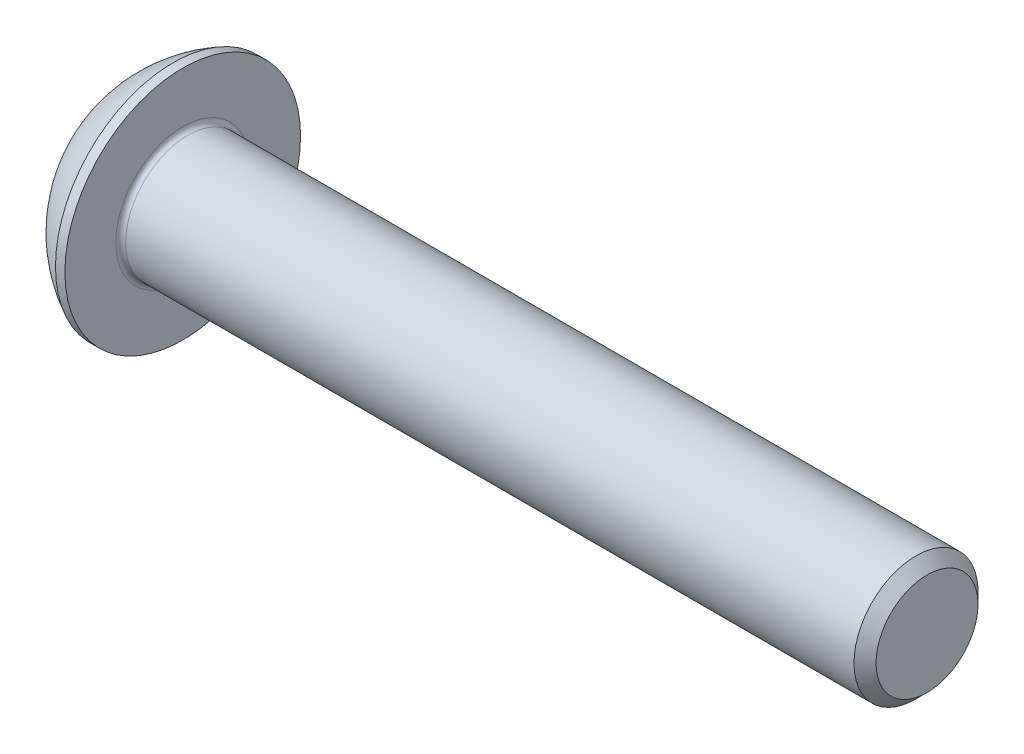
ISO-10303-21;
HEADER;
FILE_DESCRIPTION(('STEP AP214'),'2;1');
FILE_NAME('part.step','',(''),(''),'','','');
FILE_SCHEMA(('AUTOMOTIVE_DESIGN { 1 0 10303 214 1 1 1 1 }'));
ENDSEC;
DATA;
#1=APPLICATION_CONTEXT('core data for automotive mechanical design processes');
#2=APPLICATION_PROTOCOL_DEFINITION('international standard','automotive_design',2000,#1);
#3=PRODUCT_CONTEXT('',#1,'mechanical');
#4=PRODUCT('Part','Part','',(#3));
#5=PRODUCT_RELATED_PRODUCT_CATEGORY('part','',(#4));
#6=PRODUCT_DEFINITION_FORMATION('','',#4);
#7=PRODUCT_DEFINITION_CONTEXT('part definition',#1,'design');
#8=PRODUCT_DEFINITION('design','',#6,#7);
#9=PRODUCT_DEFINITION_SHAPE('','',#8);
#10=(LENGTH_UNIT() NAMED_UNIT(*) SI_UNIT(.MILLI.,.METRE.));
#11=(NAMED_UNIT(*) PLANE_ANGLE_UNIT() SI_UNIT($,.RADIAN.));
#12=(NAMED_UNIT(*) SI_UNIT($,.STERADIAN.) SOLID_ANGLE_UNIT());
#13=UNCERTAINTY_MEASURE_WITH_UNIT(LENGTH_MEASURE(1.E-05),#10,'distance_accuracy_value','');
#14=(GEOMETRIC_REPRESENTATION_CONTEXT(3) GLOBAL_UNCERTAINTY_ASSIGNED_CONTEXT((#13)) GLOBAL_UNIT_ASSIGNED_CONTEXT((#10,
#11,#12)) REPRESENTATION_CONTEXT('',''));
#15=CARTESIAN_POINT('',(0.,0.,0.));
#16=DIRECTION('',(0.,0.,1.));
#17=DIRECTION('',(1.,0.,0.));
#18=AXIS2_PLACEMENT_3D('',#15,#16,#17);
#19=CARTESIAN_POINT('',(0.,0.,0.));
#20=DIRECTION('',(-1.,0.,0.));
#21=DIRECTION('',(0.,0.,1.));
#22=AXIS2_PLACEMENT_3D('',#19,#20,#21);
#23=PLANE('',#22);
#24=CARTESIAN_POINT('',(0.,0.,0.));
#25=DIRECTION('',(-1.,0.,0.));
#26=DIRECTION('',(0.,0.,1.));
#27=AXIS2_PLACEMENT_3D('',#24,#25,#26);
#28=CIRCLE('',#27,2.375);
#29=CARTESIAN_POINT('',(0.,0.,2.375));
#30=VERTEX_POINT('',#29);
#31=EDGE_CURVE('E150',#30,#30,#28,.T.);
#32=ORIENTED_EDGE('',*,*,#31,.T.);
#33=EDGE_LOOP('',(#32));
#34=FACE_BOUND('',#33,.T.);
#35=DIRECTION('',(0.,-1.,0.));
#36=VECTOR('',#35,1.);
#37=CARTESIAN_POINT('',(0.,-0.866025403784438,1.5));
#38=LINE('',#37,#36);
#39=CARTESIAN_POINT('',(0.,0.86602540378444,1.5));
#40=VERTEX_POINT('',#39);
#41=CARTESIAN_POINT('',(0.,-0.866025403784438,1.5));
#42=VERTEX_POINT('',#41);
#43=EDGE_CURVE('E45',#40,#42,#38,.T.);
#44=ORIENTED_EDGE('',*,*,#43,.T.);
#45=DIRECTION('',(0.,-0.5,-0.866025403784439));
#46=VECTOR('',#45,1.);
#47=CARTESIAN_POINT('',(0.,-1.73205080756888,0.));
#48=LINE('',#47,#46);
#49=CARTESIAN_POINT('',(0.,-1.73205080756888,0.));
#50=VERTEX_POINT('',#49);
#51=EDGE_CURVE('E270',#42,#50,#48,.T.);
#52=ORIENTED_EDGE('',*,*,#51,.T.);
#53=DIRECTION('',(0.,0.5,-0.866025403784439));
#54=VECTOR('',#53,1.);
#55=CARTESIAN_POINT('',(0.,-0.866025403784438,-1.5));
#56=LINE('',#55,#54);
#57=CARTESIAN_POINT('',(0.,-0.866025403784438,-1.5));
#58=VERTEX_POINT('',#57);
#59=EDGE_CURVE('E125',#50,#58,#56,.T.);
#60=ORIENTED_EDGE('',*,*,#59,.T.);
#61=DIRECTION('',(0.,1.,0.));
#62=VECTOR('',#61,1.);
#63=CARTESIAN_POINT('',(0.,0.86602540378444,-1.5));
#64=LINE('',#63,#62);
#65=CARTESIAN_POINT('',(0.,0.86602540378444,-1.5));
#66=VERTEX_POINT('',#65);
#67=EDGE_CURVE('E273',#58,#66,#64,.T.);
#68=ORIENTED_EDGE('',*,*,#67,.T.);
#69=DIRECTION('',(0.,0.5,0.866025403784439));
#70=VECTOR('',#69,1.);
#71=CARTESIAN_POINT('',(0.,1.73205080756888,0.));
#72=LINE('',#71,#70);
#73=CARTESIAN_POINT('',(0.,1.73205080756888,0.));
#74=VERTEX_POINT('',#73);
#75=EDGE_CURVE('E275',#66,#74,#72,.T.);
#76=ORIENTED_EDGE('',*,*,#75,.T.);
#77=DIRECTION('',(0.,-0.5,0.866025403784439));
#78=VECTOR('',#77,1.);
#79=CARTESIAN_POINT('',(0.,0.86602540378444,1.5));
#80=LINE('',#79,#78);
#81=EDGE_CURVE('E277',#74,#40,#80,.T.);
#82=ORIENTED_EDGE('',*,*,#81,.T.);
#83=EDGE_LOOP('',(#44,#52,#60,#68,#76,#82));
#84=FACE_BOUND('',#83,.T.);
#85=ADVANCED_FACE('F30',(#34,#84),#23,.T.);
#86=CARTESIAN_POINT('',(4.75501582278481,0.,0.));
#87=DIRECTION('',(-1.,0.,0.));
#88=DIRECTION('',(0.,1.,0.));
#89=AXIS2_PLACEMENT_3D('',#86,#87,#88);
#90=SPHERICAL_SURFACE('',#89,5.3151482081814);
#91=CARTESIAN_POINT('',(2.37,0.,0.));
#92=DIRECTION('',(-1.,0.,0.));
#93=DIRECTION('',(0.,0.,1.));
#94=AXIS2_PLACEMENT_3D('',#91,#92,#93);
#95=CIRCLE('',#94,4.75);
#96=CARTESIAN_POINT('',(2.37,0.,4.75));
#97=VERTEX_POINT('',#96);
#98=EDGE_CURVE('E147',#97,#97,#95,.T.);
#99=ORIENTED_EDGE('',*,*,#98,.T.);
#100=EDGE_LOOP('',(#99));
#101=FACE_BOUND('',#100,.T.);
#102=ORIENTED_EDGE('',*,*,#31,.F.);
#103=EDGE_LOOP('',(#102));
#104=FACE_BOUND('',#103,.T.);
#105=ADVANCED_FACE('F171',(#101,#104),#90,.T.);
#106=CARTESIAN_POINT('',(0.,0.,0.));
#107=DIRECTION('',(-1.,0.,0.));
#108=DIRECTION('',(0.,0.,1.));
#109=AXIS2_PLACEMENT_3D('',#106,#107,#108);
#110=CYLINDRICAL_SURFACE('',#109,4.75);
#111=ORIENTED_EDGE('',*,*,#98,.F.);
#112=EDGE_LOOP('',(#111));
#113=FACE_BOUND('',#112,.T.);
#114=CARTESIAN_POINT('',(2.75,0.,0.));
#115=DIRECTION('',(-1.,0.,0.));
#116=DIRECTION('',(0.,0.,1.));
#117=AXIS2_PLACEMENT_3D('',#114,#115,#116);
#118=CIRCLE('',#117,4.75);
#119=CARTESIAN_POINT('',(2.75,0.,4.75));
#120=VERTEX_POINT('',#119);
#121=EDGE_CURVE('E144',#120,#120,#118,.T.);
#122=ORIENTED_EDGE('',*,*,#121,.T.);
#123=EDGE_LOOP('',(#122));
#124=FACE_BOUND('',#123,.T.);
#125=ADVANCED_FACE('F176',(#113,#124),#110,.T.);
#126=CARTESIAN_POINT('',(2.75,2.5,0.));
#127=DIRECTION('',(-1.,0.,0.));
#128=DIRECTION('',(0.,0.,1.));
#129=AXIS2_PLACEMENT_3D('',#126,#127,#128);
#130=PLANE('',#129);
#131=CARTESIAN_POINT('',(2.75,0.,0.));
#132=DIRECTION('',(-1.,0.,0.));
#133=DIRECTION('',(0.,0.,1.));
#134=AXIS2_PLACEMENT_3D('',#131,#132,#133);
#135=CIRCLE('',#134,2.7);
#136=CARTESIAN_POINT('',(2.75,0.,2.7));
#137=VERTEX_POINT('',#136);
#138=EDGE_CURVE('E38',#137,#137,#135,.T.);
#139=ORIENTED_EDGE('',*,*,#138,.T.);
#140=EDGE_LOOP('',(#139));
#141=FACE_BOUND('',#140,.T.);
#142=ORIENTED_EDGE('',*,*,#121,.F.);
#143=EDGE_LOOP('',(#142));
#144=FACE_BOUND('',#143,.T.);
#145=ADVANCED_FACE('F155',(#141,#144),#130,.F.);
#146=CARTESIAN_POINT('',(0.,0.,0.));
#147=DIRECTION('',(-1.,0.,0.));
#148=DIRECTION('',(0.,0.,1.));
#149=AXIS2_PLACEMENT_3D('',#146,#147,#148);
#150=CYLINDRICAL_SURFACE('',#149,2.5);
#151=CARTESIAN_POINT('',(2.95,0.,0.));
#152=DIRECTION('',(-1.,0.,0.));
#153=DIRECTION('',(0.,0.,1.));
#154=AXIS2_PLACEMENT_3D('',#151,#152,#153);
#155=CIRCLE('',#154,2.5);
#156=CARTESIAN_POINT('',(2.95,0.,2.5));
#157=VERTEX_POINT('',#156);
#158=EDGE_CURVE('E11',#157,#157,#155,.F.);
#159=ORIENTED_EDGE('',*,*,#158,.T.);
#160=EDGE_LOOP('',(#159));
#161=FACE_BOUND('',#160,.T.);
#162=CARTESIAN_POINT('',(32.305,0.,0.));
#163=DIRECTION('',(-1.,0.,0.));
#164=DIRECTION('',(0.,0.,1.));
#165=AXIS2_PLACEMENT_3D('',#162,#163,#164);
#166=CIRCLE('',#165,2.5);
#167=CARTESIAN_POINT('',(32.305,0.,2.5));
#168=VERTEX_POINT('',#167);
#169=EDGE_CURVE('E141',#168,#168,#166,.T.);
#170=ORIENTED_EDGE('',*,*,#169,.T.);
#171=EDGE_LOOP('',(#170));
#172=FACE_BOUND('',#171,.T.);
#173=ADVANCED_FACE('F185',(#161,#172),#150,.T.);
#174=CARTESIAN_POINT('',(32.75,0.,0.));
#175=DIRECTION('',(-1.,0.,0.));
#176=DIRECTION('',(0.,0.,1.));
#177=AXIS2_PLACEMENT_3D('',#174,#175,#176);
#178=CONICAL_SURFACE('',#177,2.055,0.785398163397434);
#179=ORIENTED_EDGE('',*,*,#169,.F.);
#180=EDGE_LOOP('',(#179));
#181=FACE_BOUND('',#180,.T.);
#182=CARTESIAN_POINT('',(32.75,0.,0.));
#183=DIRECTION('',(-1.,0.,0.));
#184=DIRECTION('',(0.,0.,1.));
#185=AXIS2_PLACEMENT_3D('',#182,#183,#184);
#186=CIRCLE('',#185,2.055);
#187=CARTESIAN_POINT('',(32.75,0.,2.055));
#188=VERTEX_POINT('',#187);
#189=EDGE_CURVE('E137',#188,#188,#186,.T.);
#190=ORIENTED_EDGE('',*,*,#189,.T.);
#191=EDGE_LOOP('',(#190));
#192=FACE_BOUND('',#191,.T.);
#193=ADVANCED_FACE('F166',(#181,#192),#178,.T.);
#194=CARTESIAN_POINT('',(32.75,0.,0.));
#195=DIRECTION('',(-1.,0.,0.));
#196=DIRECTION('',(0.,0.,1.));
#197=AXIS2_PLACEMENT_3D('',#194,#195,#196);
#198=PLANE('',#197);
#199=ORIENTED_EDGE('',*,*,#189,.F.);
#200=EDGE_LOOP('',(#199));
#201=FACE_BOUND('',#200,.T.);
#202=ADVANCED_FACE('F159',(#201),#198,.F.);
#203=CARTESIAN_POINT('',(2.95,0.,0.));
#204=DIRECTION('',(-1.,0.,0.));
#205=DIRECTION('',(0.,0.,1.));
#206=AXIS2_PLACEMENT_3D('',#203,#204,#205);
#207=TOROIDAL_SURFACE('',#206,2.7,0.2);
#208=ORIENTED_EDGE('',*,*,#158,.F.);
#209=EDGE_LOOP('',(#208));
#210=FACE_BOUND('',#209,.T.);
#211=ORIENTED_EDGE('',*,*,#138,.F.);
#212=EDGE_LOOP('',(#211));
#213=FACE_BOUND('',#212,.T.);
#214=ADVANCED_FACE('F32',(#210,#213),#207,.F.);
#215=CARTESIAN_POINT('',(1.56,-1.73205080756888,0.));
#216=DIRECTION('',(0.,0.866025403784439,-0.5));
#217=DIRECTION('',(0.,0.5,0.866025403784439));
#218=AXIS2_PLACEMENT_3D('',#215,#216,#217);
#219=PLANE('',#218);
#220=DIRECTION('',(0.,-0.5,-0.866025403784439));
#221=VECTOR('',#220,1.);
#222=CARTESIAN_POINT('',(1.56,-1.73205080756888,0.));
#223=LINE('',#222,#221);
#224=CARTESIAN_POINT('',(1.56,-0.866025403784438,1.5));
#225=VERTEX_POINT('',#224);
#226=CARTESIAN_POINT('',(1.56,-1.29903810567666,0.75));
#227=VERTEX_POINT('',#226);
#228=EDGE_CURVE('E111',#225,#227,#223,.T.);
#229=ORIENTED_EDGE('',*,*,#228,.T.);
#230=CARTESIAN_POINT('',(1.56,-1.73205080756888,0.));
#231=VERTEX_POINT('',#230);
#232=EDGE_CURVE('E106',#227,#231,#223,.T.);
#233=ORIENTED_EDGE('',*,*,#232,.T.);
#234=DIRECTION('',(-1.,0.,0.));
#235=VECTOR('',#234,1.);
#236=CARTESIAN_POINT('',(1.56,-1.73205080756888,0.));
#237=LINE('',#236,#235);
#238=EDGE_CURVE('E108',#231,#50,#237,.T.);
#239=ORIENTED_EDGE('',*,*,#238,.T.);
#240=ORIENTED_EDGE('',*,*,#51,.F.);
#241=DIRECTION('',(-1.,0.,0.));
#242=VECTOR('',#241,1.);
#243=CARTESIAN_POINT('',(1.56,-0.866025403784438,1.5));
#244=LINE('',#243,#242);
#245=EDGE_CURVE('E266',#225,#42,#244,.T.);
#246=ORIENTED_EDGE('',*,*,#245,.F.);
#247=EDGE_LOOP('',(#229,#233,#239,#240,#246));
#248=FACE_BOUND('',#247,.T.);
#249=ADVANCED_FACE('F107',(#248),#219,.T.);
#250=CARTESIAN_POINT('',(1.56,-0.866025403784438,-1.5));
#251=DIRECTION('',(0.,0.866025403784438,0.5));
#252=DIRECTION('',(0.,-0.5,0.866025403784439));
#253=AXIS2_PLACEMENT_3D('',#250,#251,#252);
#254=PLANE('',#253);
#255=DIRECTION('',(0.,0.5,-0.866025403784439));
#256=VECTOR('',#255,1.);
#257=CARTESIAN_POINT('',(1.56,-0.866025403784438,-1.5));
#258=LINE('',#257,#256);
#259=CARTESIAN_POINT('',(1.56,-1.29903810567666,-0.75));
#260=VERTEX_POINT('',#259);
#261=EDGE_CURVE('E53',#231,#260,#258,.T.);
#262=ORIENTED_EDGE('',*,*,#261,.T.);
#263=CARTESIAN_POINT('',(1.56,-0.866025403784438,-1.5));
#264=VERTEX_POINT('',#263);
#265=EDGE_CURVE('E120',#260,#264,#258,.T.);
#266=ORIENTED_EDGE('',*,*,#265,.T.);
#267=DIRECTION('',(-1.,0.,0.));
#268=VECTOR('',#267,1.);
#269=CARTESIAN_POINT('',(1.56,-0.866025403784438,-1.5));
#270=LINE('',#269,#268);
#271=EDGE_CURVE('E127',#264,#58,#270,.T.);
#272=ORIENTED_EDGE('',*,*,#271,.T.);
#273=ORIENTED_EDGE('',*,*,#59,.F.);
#274=ORIENTED_EDGE('',*,*,#238,.F.);
#275=EDGE_LOOP('',(#262,#266,#272,#273,#274));
#276=FACE_BOUND('',#275,.T.);
#277=ADVANCED_FACE('F123',(#276),#254,.T.);
#278=CARTESIAN_POINT('',(1.56,0.86602540378444,-1.5));
#279=DIRECTION('',(0.,0.,1.));
#280=DIRECTION('',(1.,0.,0.));
#281=AXIS2_PLACEMENT_3D('',#278,#279,#280);
#282=PLANE('',#281);
#283=DIRECTION('',(0.,1.,0.));
#284=VECTOR('',#283,1.);
#285=CARTESIAN_POINT('',(1.56,0.86602540378444,-1.5));
#286=LINE('',#285,#284);
#287=CARTESIAN_POINT('',(1.56,0.,-1.5));
#288=VERTEX_POINT('',#287);
#289=EDGE_CURVE('E247',#264,#288,#286,.T.);
#290=ORIENTED_EDGE('',*,*,#289,.T.);
#291=CARTESIAN_POINT('',(1.56,0.86602540378444,-1.5));
#292=VERTEX_POINT('',#291);
#293=EDGE_CURVE('E119',#288,#292,#286,.T.);
#294=ORIENTED_EDGE('',*,*,#293,.T.);
#295=DIRECTION('',(-1.,0.,0.));
#296=VECTOR('',#295,1.);
#297=CARTESIAN_POINT('',(1.56,0.86602540378444,-1.5));
#298=LINE('',#297,#296);
#299=EDGE_CURVE('E132',#292,#66,#298,.T.);
#300=ORIENTED_EDGE('',*,*,#299,.T.);
#301=ORIENTED_EDGE('',*,*,#67,.F.);
#302=ORIENTED_EDGE('',*,*,#271,.F.);
#303=EDGE_LOOP('',(#290,#294,#300,#301,#302));
#304=FACE_BOUND('',#303,.T.);
#305=ADVANCED_FACE('F199',(#304),#282,.T.);
#306=CARTESIAN_POINT('',(1.56,1.73205080756888,0.));
#307=DIRECTION('',(0.,-0.866025403784439,0.5));
#308=DIRECTION('',(0.,-0.5,-0.866025403784439));
#309=AXIS2_PLACEMENT_3D('',#306,#307,#308);
#310=PLANE('',#309);
#311=DIRECTION('',(0.,0.5,0.866025403784439));
#312=VECTOR('',#311,1.);
#313=CARTESIAN_POINT('',(1.56,1.73205080756888,0.));
#314=LINE('',#313,#312);
#315=CARTESIAN_POINT('',(1.56,1.29903810567666,-0.75));
#316=VERTEX_POINT('',#315);
#317=EDGE_CURVE('E236',#292,#316,#314,.T.);
#318=ORIENTED_EDGE('',*,*,#317,.T.);
#319=CARTESIAN_POINT('',(1.56,1.73205080756888,0.));
#320=VERTEX_POINT('',#319);
#321=EDGE_CURVE('E241',#316,#320,#314,.T.);
#322=ORIENTED_EDGE('',*,*,#321,.T.);
#323=DIRECTION('',(-1.,0.,0.));
#324=VECTOR('',#323,1.);
#325=CARTESIAN_POINT('',(1.56,1.73205080756888,0.));
#326=LINE('',#325,#324);
#327=EDGE_CURVE('E281',#320,#74,#326,.T.);
#328=ORIENTED_EDGE('',*,*,#327,.T.);
#329=ORIENTED_EDGE('',*,*,#75,.F.);
#330=ORIENTED_EDGE('',*,*,#299,.F.);
#331=EDGE_LOOP('',(#318,#322,#328,#329,#330));
#332=FACE_BOUND('',#331,.T.);
#333=ADVANCED_FACE('F202',(#332),#310,.T.);
#334=CARTESIAN_POINT('',(1.56,0.86602540378444,1.5));
#335=DIRECTION('',(0.,-0.866025403784439,-0.5));
#336=DIRECTION('',(0.,0.5,-0.866025403784439));
#337=AXIS2_PLACEMENT_3D('',#334,#335,#336);
#338=PLANE('',#337);
#339=DIRECTION('',(0.,-0.5,0.866025403784439));
#340=VECTOR('',#339,1.);
#341=CARTESIAN_POINT('',(1.56,0.86602540378444,1.5));
#342=LINE('',#341,#340);
#343=CARTESIAN_POINT('',(1.56,1.29903810567666,0.75));
#344=VERTEX_POINT('',#343);
#345=EDGE_CURVE('E244',#320,#344,#342,.T.);
#346=ORIENTED_EDGE('',*,*,#345,.T.);
#347=CARTESIAN_POINT('',(1.56,0.86602540378444,1.5));
#348=VERTEX_POINT('',#347);
#349=EDGE_CURVE('E252',#344,#348,#342,.T.);
#350=ORIENTED_EDGE('',*,*,#349,.T.);
#351=DIRECTION('',(-1.,0.,0.));
#352=VECTOR('',#351,1.);
#353=CARTESIAN_POINT('',(1.56,0.86602540378444,1.5));
#354=LINE('',#353,#352);
#355=EDGE_CURVE('E265',#348,#40,#354,.T.);
#356=ORIENTED_EDGE('',*,*,#355,.T.);
#357=ORIENTED_EDGE('',*,*,#81,.F.);
#358=ORIENTED_EDGE('',*,*,#327,.F.);
#359=EDGE_LOOP('',(#346,#350,#356,#357,#358));
#360=FACE_BOUND('',#359,.T.);
#361=ADVANCED_FACE('F206',(#360),#338,.T.);
#362=CARTESIAN_POINT('',(1.56,-0.866025403784438,1.5));
#363=DIRECTION('',(0.,0.,-1.));
#364=DIRECTION('',(-1.,0.,0.));
#365=AXIS2_PLACEMENT_3D('',#362,#363,#364);
#366=PLANE('',#365);
#367=DIRECTION('',(0.,-1.,0.));
#368=VECTOR('',#367,1.);
#369=CARTESIAN_POINT('',(1.56,-0.866025403784438,1.5));
#370=LINE('',#369,#368);
#371=CARTESIAN_POINT('',(1.56,0.,1.5));
#372=VERTEX_POINT('',#371);
#373=EDGE_CURVE('E258',#348,#372,#370,.T.);
#374=ORIENTED_EDGE('',*,*,#373,.T.);
#375=EDGE_CURVE('E260',#372,#225,#370,.T.);
#376=ORIENTED_EDGE('',*,*,#375,.T.);
#377=ORIENTED_EDGE('',*,*,#245,.T.);
#378=ORIENTED_EDGE('',*,*,#43,.F.);
#379=ORIENTED_EDGE('',*,*,#355,.F.);
#380=EDGE_LOOP('',(#374,#376,#377,#378,#379));
#381=FACE_BOUND('',#380,.T.);
#382=ADVANCED_FACE('F210',(#381),#366,.T.);
#383=CARTESIAN_POINT('',(1.56,-1.73205080756888,0.));
#384=DIRECTION('',(1.,0.,0.));
#385=DIRECTION('',(0.,0.,-1.));
#386=AXIS2_PLACEMENT_3D('',#383,#384,#385);
#387=PLANE('',#386);
#388=CARTESIAN_POINT('',(1.56,0.,0.));
#389=DIRECTION('',(-1.,0.,0.));
#390=DIRECTION('',(0.,0.,1.));
#391=AXIS2_PLACEMENT_3D('',#388,#389,#390);
#392=CIRCLE('',#391,1.5);
#393=EDGE_CURVE('E233',#316,#288,#392,.T.);
#394=ORIENTED_EDGE('',*,*,#393,.F.);
#395=ORIENTED_EDGE('',*,*,#317,.F.);
#396=ORIENTED_EDGE('',*,*,#293,.F.);
#397=EDGE_LOOP('',(#394,#395,#396));
#398=FACE_BOUND('',#397,.T.);
#399=ADVANCED_FACE('F214',(#398),#387,.F.);
#400=EDGE_CURVE('E138',#344,#316,#392,.T.);
#401=ORIENTED_EDGE('',*,*,#400,.F.);
#402=ORIENTED_EDGE('',*,*,#345,.F.);
#403=ORIENTED_EDGE('',*,*,#321,.F.);
#404=EDGE_LOOP('',(#401,#402,#403));
#405=FACE_BOUND('',#404,.T.);
#406=ADVANCED_FACE('F223',(#405),#387,.F.);
#407=EDGE_CURVE('E131',#372,#344,#392,.T.);
#408=ORIENTED_EDGE('',*,*,#407,.F.);
#409=ORIENTED_EDGE('',*,*,#373,.F.);
#410=ORIENTED_EDGE('',*,*,#349,.F.);
#411=EDGE_LOOP('',(#408,#409,#410));
#412=FACE_BOUND('',#411,.T.);
#413=ADVANCED_FACE('F228',(#412),#387,.F.);
#414=EDGE_CURVE('E126',#227,#372,#392,.T.);
#415=ORIENTED_EDGE('',*,*,#414,.F.);
#416=ORIENTED_EDGE('',*,*,#228,.F.);
#417=ORIENTED_EDGE('',*,*,#375,.F.);
#418=EDGE_LOOP('',(#415,#416,#417));
#419=FACE_BOUND('',#418,.T.);
#420=ADVANCED_FACE('F221',(#419),#387,.F.);
#421=EDGE_CURVE('E117',#260,#227,#392,.T.);
#422=ORIENTED_EDGE('',*,*,#421,.F.);
#423=ORIENTED_EDGE('',*,*,#261,.F.);
#424=ORIENTED_EDGE('',*,*,#232,.F.);
#425=EDGE_LOOP('',(#422,#423,#424));
#426=FACE_BOUND('',#425,.T.);
#427=ADVANCED_FACE('F116',(#426),#387,.F.);
#428=EDGE_CURVE('E239',#288,#260,#392,.T.);
#429=ORIENTED_EDGE('',*,*,#428,.F.);
#430=ORIENTED_EDGE('',*,*,#289,.F.);
#431=ORIENTED_EDGE('',*,*,#265,.F.);
#432=EDGE_LOOP('',(#429,#430,#431));
#433=FACE_BOUND('',#432,.T.);
#434=ADVANCED_FACE('F194',(#433),#387,.F.);
#435=CARTESIAN_POINT('',(2.42602540378445,0.,0.));
#436=DIRECTION('',(-1.,0.,0.));
#437=DIRECTION('',(0.,0.,1.));
#438=AXIS2_PLACEMENT_3D('',#435,#436,#437);
#439=CONICAL_SURFACE('',#438,0.,1.04719755119659);
#440=ORIENTED_EDGE('',*,*,#407,.T.);
#441=ORIENTED_EDGE('',*,*,#400,.T.);
#442=ORIENTED_EDGE('',*,*,#393,.T.);
#443=ORIENTED_EDGE('',*,*,#428,.T.);
#444=ORIENTED_EDGE('',*,*,#421,.T.);
#445=ORIENTED_EDGE('',*,*,#414,.T.);
#446=EDGE_LOOP('',(#440,#441,#442,#443,#444,#445));
#447=FACE_BOUND('',#446,.T.);
#448=CARTESIAN_POINT('',(2.42602540378445,0.,0.));
#449=VERTEX_POINT('',#448);
#450=VERTEX_LOOP('',#449);
#451=FACE_BOUND('',#450,.T.);
#452=ADVANCED_FACE('F192',(#447,#451),#439,.F.);
#453=CLOSED_SHELL('',(#85,#105,#125,#145,#173,#193,#202,#214,#249,#277,#305,#333,#361,#382,#399,
#406,#413,#420,#427,#434,#452));
#454=MANIFOLD_SOLID_BREP('B2',#453);
#455=ADVANCED_BREP_SHAPE_REPRESENTATION('',(#18,#454),#14);
#456=SHAPE_DEFINITION_REPRESENTATION(#9,#455);
ENDSEC;
END-ISO-10303-21;
